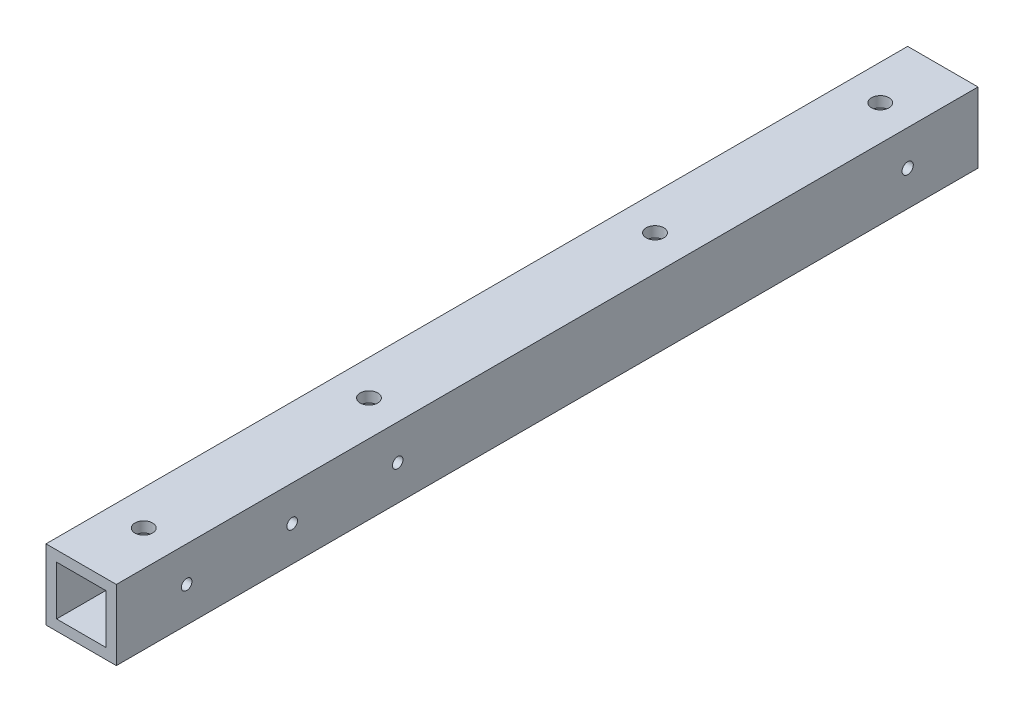
ISO-10303-21;
HEADER;
FILE_DESCRIPTION(('STEP AP214'),'2;1');
FILE_NAME('part.step','',(''),(''),'','','');
FILE_SCHEMA(('AUTOMOTIVE_DESIGN { 1 0 10303 214 1 1 1 1 }'));
ENDSEC;
DATA;
#1=APPLICATION_CONTEXT('core data for automotive mechanical design processes');
#2=APPLICATION_PROTOCOL_DEFINITION('international standard','automotive_design',2000,#1);
#3=PRODUCT_CONTEXT('',#1,'mechanical');
#4=PRODUCT('Part','Part','',(#3));
#5=PRODUCT_RELATED_PRODUCT_CATEGORY('part','',(#4));
#6=PRODUCT_DEFINITION_FORMATION('','',#4);
#7=PRODUCT_DEFINITION_CONTEXT('part definition',#1,'design');
#8=PRODUCT_DEFINITION('design','',#6,#7);
#9=PRODUCT_DEFINITION_SHAPE('','',#8);
#10=(LENGTH_UNIT() NAMED_UNIT(*) SI_UNIT(.MILLI.,.METRE.));
#11=(NAMED_UNIT(*) PLANE_ANGLE_UNIT() SI_UNIT($,.RADIAN.));
#12=(NAMED_UNIT(*) SI_UNIT($,.STERADIAN.) SOLID_ANGLE_UNIT());
#13=UNCERTAINTY_MEASURE_WITH_UNIT(LENGTH_MEASURE(1.E-05),#10,'distance_accuracy_value','');
#14=(GEOMETRIC_REPRESENTATION_CONTEXT(3) GLOBAL_UNCERTAINTY_ASSIGNED_CONTEXT((#13)) GLOBAL_UNIT_ASSIGNED_CONTEXT((#10,
#11,#12)) REPRESENTATION_CONTEXT('',''));
#15=CARTESIAN_POINT('',(0.,0.,0.));
#16=DIRECTION('',(0.,0.,1.));
#17=DIRECTION('',(1.,0.,0.));
#18=AXIS2_PLACEMENT_3D('',#15,#16,#17);
#19=CARTESIAN_POINT('',(-9.33333333333334,11.0061476485938,245.));
#20=DIRECTION('',(0.,-1.,0.));
#21=DIRECTION('',(1.,0.,0.));
#22=AXIS2_PLACEMENT_3D('',#19,#20,#21);
#23=PLANE('',#22);
#24=CARTESIAN_POINT('',(0.666666666688432,11.0061476485938,17.7882326790933));
#25=DIRECTION('',(0.,1.,0.));
#26=DIRECTION('',(-1.,0.,0.));
#27=AXIS2_PLACEMENT_3D('',#24,#25,#26);
#28=CIRCLE('',#27,2.5);
#29=CARTESIAN_POINT('',(-1.83333333331157,11.0061476485938,17.7882326790933));
#30=VERTEX_POINT('',#29);
#31=EDGE_CURVE('E194',#30,#30,#28,.T.);
#32=ORIENTED_EDGE('',*,*,#31,.F.);
#33=EDGE_LOOP('',(#32));
#34=FACE_BOUND('',#33,.T.);
#35=CARTESIAN_POINT('',(0.666666666815553,11.0061476485938,81.833059371292));
#36=DIRECTION('',(0.,1.,0.));
#37=DIRECTION('',(-1.,0.,0.));
#38=AXIS2_PLACEMENT_3D('',#35,#36,#37);
#39=CIRCLE('',#38,2.5);
#40=CARTESIAN_POINT('',(-1.83333333318445,11.0061476485938,81.833059371292));
#41=VERTEX_POINT('',#40);
#42=EDGE_CURVE('E292',#41,#41,#39,.T.);
#43=ORIENTED_EDGE('',*,*,#42,.F.);
#44=EDGE_LOOP('',(#43));
#45=FACE_BOUND('',#44,.T.);
#46=CARTESIAN_POINT('',(0.6666666669578,11.0061476485938,163.166940628601));
#47=DIRECTION('',(0.,1.,0.));
#48=DIRECTION('',(-1.,0.,0.));
#49=AXIS2_PLACEMENT_3D('',#46,#47,#48);
#50=CIRCLE('',#49,2.5);
#51=CARTESIAN_POINT('',(-1.8333333330422,11.0061476485938,163.166940628601));
#52=VERTEX_POINT('',#51);
#53=EDGE_CURVE('E296',#52,#52,#50,.T.);
#54=ORIENTED_EDGE('',*,*,#53,.F.);
#55=EDGE_LOOP('',(#54));
#56=FACE_BOUND('',#55,.T.);
#57=CARTESIAN_POINT('',(0.666666667054695,11.0061476485938,227.2117673208));
#58=DIRECTION('',(0.,1.,0.));
#59=DIRECTION('',(-1.,0.,0.));
#60=AXIS2_PLACEMENT_3D('',#57,#58,#59);
#61=CIRCLE('',#60,2.5);
#62=CARTESIAN_POINT('',(-1.83333333294531,11.0061476485938,227.2117673208));
#63=VERTEX_POINT('',#62);
#64=EDGE_CURVE('E300',#63,#63,#61,.T.);
#65=ORIENTED_EDGE('',*,*,#64,.F.);
#66=EDGE_LOOP('',(#65));
#67=FACE_BOUND('',#66,.T.);
#68=DIRECTION('',(-1.,0.,0.));
#69=VECTOR('',#68,1.);
#70=CARTESIAN_POINT('',(-9.33333333333334,11.0061476485938,0.));
#71=LINE('',#70,#69);
#72=CARTESIAN_POINT('',(10.6666666666667,11.0061476485938,0.));
#73=VERTEX_POINT('',#72);
#74=CARTESIAN_POINT('',(-9.33333333333334,11.0061476485938,0.));
#75=VERTEX_POINT('',#74);
#76=EDGE_CURVE('E141',#73,#75,#71,.T.);
#77=ORIENTED_EDGE('',*,*,#76,.T.);
#78=DIRECTION('',(0.,0.,-1.));
#79=VECTOR('',#78,1.);
#80=CARTESIAN_POINT('',(-9.33333333333334,11.0061476485938,245.));
#81=LINE('',#80,#79);
#82=CARTESIAN_POINT('',(-9.33333333333334,11.0061476485938,245.));
#83=VERTEX_POINT('',#82);
#84=EDGE_CURVE('E11',#83,#75,#81,.T.);
#85=ORIENTED_EDGE('',*,*,#84,.F.);
#86=DIRECTION('',(-1.,0.,0.));
#87=VECTOR('',#86,1.);
#88=CARTESIAN_POINT('',(-9.33333333333334,11.0061476485938,245.));
#89=LINE('',#88,#87);
#90=CARTESIAN_POINT('',(10.6666666666667,11.0061476485938,245.));
#91=VERTEX_POINT('',#90);
#92=EDGE_CURVE('E145',#91,#83,#89,.T.);
#93=ORIENTED_EDGE('',*,*,#92,.F.);
#94=DIRECTION('',(0.,0.,-1.));
#95=VECTOR('',#94,1.);
#96=CARTESIAN_POINT('',(10.6666666666667,11.0061476485938,245.));
#97=LINE('',#96,#95);
#98=EDGE_CURVE('E155',#91,#73,#97,.T.);
#99=ORIENTED_EDGE('',*,*,#98,.T.);
#100=EDGE_LOOP('',(#77,#85,#93,#99));
#101=FACE_BOUND('',#100,.T.);
#102=ADVANCED_FACE('F39',(#34,#45,#56,#67,#101),#23,.F.);
#103=CARTESIAN_POINT('',(-9.33333333333334,11.0061476485938,245.));
#104=DIRECTION('',(1.,0.,0.));
#105=DIRECTION('',(0.,0.,-1.));
#106=AXIS2_PLACEMENT_3D('',#103,#104,#105);
#107=PLANE('',#106);
#108=CARTESIAN_POINT('',(-9.33333333333334,1.00614764859386,225.));
#109=DIRECTION('',(-1.,0.,0.));
#110=DIRECTION('',(0.,0.,1.));
#111=AXIS2_PLACEMENT_3D('',#108,#109,#110);
#112=CIRCLE('',#111,1.5);
#113=CARTESIAN_POINT('',(-9.33333333333334,1.00614764859386,226.5));
#114=VERTEX_POINT('',#113);
#115=EDGE_CURVE('E174',#114,#114,#112,.T.);
#116=ORIENTED_EDGE('',*,*,#115,.F.);
#117=EDGE_LOOP('',(#116));
#118=FACE_BOUND('',#117,.T.);
#119=CARTESIAN_POINT('',(-9.33333333333334,1.00614764859386,195.));
#120=DIRECTION('',(-1.,0.,0.));
#121=DIRECTION('',(0.,0.,1.));
#122=AXIS2_PLACEMENT_3D('',#119,#120,#121);
#123=CIRCLE('',#122,1.5);
#124=CARTESIAN_POINT('',(-9.33333333333334,1.00614764859386,196.5));
#125=VERTEX_POINT('',#124);
#126=EDGE_CURVE('E227',#125,#125,#123,.T.);
#127=ORIENTED_EDGE('',*,*,#126,.F.);
#128=EDGE_LOOP('',(#127));
#129=FACE_BOUND('',#128,.T.);
#130=CARTESIAN_POINT('',(-9.33333333333334,1.00614764859387,165.));
#131=DIRECTION('',(-1.,0.,0.));
#132=DIRECTION('',(0.,0.,1.));
#133=AXIS2_PLACEMENT_3D('',#130,#131,#132);
#134=CIRCLE('',#133,1.50000000000002);
#135=CARTESIAN_POINT('',(-9.33333333333334,1.00614764859387,166.5));
#136=VERTEX_POINT('',#135);
#137=EDGE_CURVE('E230',#136,#136,#134,.T.);
#138=ORIENTED_EDGE('',*,*,#137,.F.);
#139=EDGE_LOOP('',(#138));
#140=FACE_BOUND('',#139,.T.);
#141=CARTESIAN_POINT('',(-9.33333333333334,1.00614764859194,19.9999999999818));
#142=DIRECTION('',(-1.,0.,0.));
#143=DIRECTION('',(0.,0.,1.));
#144=AXIS2_PLACEMENT_3D('',#141,#142,#143);
#145=CIRCLE('',#144,1.6);
#146=CARTESIAN_POINT('',(-9.33333333333334,1.00614764859194,21.5999999999818));
#147=VERTEX_POINT('',#146);
#148=EDGE_CURVE('E224',#147,#147,#145,.T.);
#149=ORIENTED_EDGE('',*,*,#148,.F.);
#150=EDGE_LOOP('',(#149));
#151=FACE_BOUND('',#150,.T.);
#152=DIRECTION('',(0.,-1.,0.));
#153=VECTOR('',#152,1.);
#154=CARTESIAN_POINT('',(-9.33333333333334,11.0061476485938,0.));
#155=LINE('',#154,#153);
#156=CARTESIAN_POINT('',(-9.33333333333334,-8.99385235140616,0.));
#157=VERTEX_POINT('',#156);
#158=EDGE_CURVE('E158',#75,#157,#155,.T.);
#159=ORIENTED_EDGE('',*,*,#158,.T.);
#160=DIRECTION('',(0.,0.,-1.));
#161=VECTOR('',#160,1.);
#162=CARTESIAN_POINT('',(-9.33333333333334,-8.99385235140616,245.));
#163=LINE('',#162,#161);
#164=CARTESIAN_POINT('',(-9.33333333333334,-8.99385235140616,245.));
#165=VERTEX_POINT('',#164);
#166=EDGE_CURVE('E47',#165,#157,#163,.T.);
#167=ORIENTED_EDGE('',*,*,#166,.F.);
#168=DIRECTION('',(0.,-1.,0.));
#169=VECTOR('',#168,1.);
#170=CARTESIAN_POINT('',(-9.33333333333334,11.0061476485938,245.));
#171=LINE('',#170,#169);
#172=EDGE_CURVE('E148',#83,#165,#171,.T.);
#173=ORIENTED_EDGE('',*,*,#172,.F.);
#174=ORIENTED_EDGE('',*,*,#84,.T.);
#175=EDGE_LOOP('',(#159,#167,#173,#174));
#176=FACE_BOUND('',#175,.T.);
#177=ADVANCED_FACE('F278',(#118,#129,#140,#151,#176),#107,.F.);
#178=CARTESIAN_POINT('',(-9.33333333333334,-8.99385235140616,245.));
#179=DIRECTION('',(0.,1.,0.));
#180=DIRECTION('',(-1.,0.,0.));
#181=AXIS2_PLACEMENT_3D('',#178,#179,#180);
#182=PLANE('',#181);
#183=CARTESIAN_POINT('',(0.666666666688441,-8.99385235140617,17.7882326790933));
#184=DIRECTION('',(0.,1.,0.));
#185=DIRECTION('',(-1.,0.,0.));
#186=AXIS2_PLACEMENT_3D('',#183,#184,#185);
#187=CIRCLE('',#186,2.5);
#188=CARTESIAN_POINT('',(-1.83333333331156,-8.99385235140617,17.7882326790933));
#189=VERTEX_POINT('',#188);
#190=EDGE_CURVE('E221',#189,#189,#187,.T.);
#191=ORIENTED_EDGE('',*,*,#190,.T.);
#192=EDGE_LOOP('',(#191));
#193=FACE_BOUND('',#192,.T.);
#194=CARTESIAN_POINT('',(0.666666666815561,-8.99385235140617,81.833059371292));
#195=DIRECTION('',(0.,1.,0.));
#196=DIRECTION('',(-1.,0.,0.));
#197=AXIS2_PLACEMENT_3D('',#194,#195,#196);
#198=CIRCLE('',#197,2.5);
#199=CARTESIAN_POINT('',(-1.83333333318444,-8.99385235140617,81.833059371292));
#200=VERTEX_POINT('',#199);
#201=EDGE_CURVE('E206',#200,#200,#198,.T.);
#202=ORIENTED_EDGE('',*,*,#201,.T.);
#203=EDGE_LOOP('',(#202));
#204=FACE_BOUND('',#203,.T.);
#205=CARTESIAN_POINT('',(0.666666666957809,-8.99385235140617,163.166940628601));
#206=DIRECTION('',(0.,1.,0.));
#207=DIRECTION('',(-1.,0.,0.));
#208=AXIS2_PLACEMENT_3D('',#205,#206,#207);
#209=CIRCLE('',#208,2.5);
#210=CARTESIAN_POINT('',(-1.83333333304219,-8.99385235140617,163.166940628601));
#211=VERTEX_POINT('',#210);
#212=EDGE_CURVE('E202',#211,#211,#209,.T.);
#213=ORIENTED_EDGE('',*,*,#212,.T.);
#214=EDGE_LOOP('',(#213));
#215=FACE_BOUND('',#214,.T.);
#216=CARTESIAN_POINT('',(0.666666667054703,-8.99385235140617,227.2117673208));
#217=DIRECTION('',(0.,1.,0.));
#218=DIRECTION('',(-1.,0.,0.));
#219=AXIS2_PLACEMENT_3D('',#216,#217,#218);
#220=CIRCLE('',#219,2.5);
#221=CARTESIAN_POINT('',(-1.8333333329453,-8.99385235140617,227.2117673208));
#222=VERTEX_POINT('',#221);
#223=EDGE_CURVE('E198',#222,#222,#220,.T.);
#224=ORIENTED_EDGE('',*,*,#223,.T.);
#225=EDGE_LOOP('',(#224));
#226=FACE_BOUND('',#225,.T.);
#227=DIRECTION('',(1.,0.,0.));
#228=VECTOR('',#227,1.);
#229=CARTESIAN_POINT('',(-9.33333333333334,-8.99385235140616,0.));
#230=LINE('',#229,#228);
#231=CARTESIAN_POINT('',(10.6666666666667,-8.99385235140615,0.));
#232=VERTEX_POINT('',#231);
#233=EDGE_CURVE('E160',#157,#232,#230,.T.);
#234=ORIENTED_EDGE('',*,*,#233,.T.);
#235=DIRECTION('',(0.,0.,-1.));
#236=VECTOR('',#235,1.);
#237=CARTESIAN_POINT('',(10.6666666666667,-8.99385235140615,245.));
#238=LINE('',#237,#236);
#239=CARTESIAN_POINT('',(10.6666666666667,-8.99385235140615,245.));
#240=VERTEX_POINT('',#239);
#241=EDGE_CURVE('E165',#240,#232,#238,.T.);
#242=ORIENTED_EDGE('',*,*,#241,.F.);
#243=DIRECTION('',(1.,0.,0.));
#244=VECTOR('',#243,1.);
#245=CARTESIAN_POINT('',(-9.33333333333334,-8.99385235140616,245.));
#246=LINE('',#245,#244);
#247=EDGE_CURVE('E151',#165,#240,#246,.T.);
#248=ORIENTED_EDGE('',*,*,#247,.F.);
#249=ORIENTED_EDGE('',*,*,#166,.T.);
#250=EDGE_LOOP('',(#234,#242,#248,#249));
#251=FACE_BOUND('',#250,.T.);
#252=ADVANCED_FACE('F284',(#193,#204,#215,#226,#251),#182,.F.);
#253=CARTESIAN_POINT('',(10.6666666666667,11.0061476485938,245.));
#254=DIRECTION('',(-1.,0.,0.));
#255=DIRECTION('',(0.,-1.,0.));
#256=AXIS2_PLACEMENT_3D('',#253,#254,#255);
#257=PLANE('',#256);
#258=CARTESIAN_POINT('',(10.6666666666667,1.00614764859386,225.));
#259=DIRECTION('',(-1.,0.,0.));
#260=DIRECTION('',(0.,-1.,0.));
#261=AXIS2_PLACEMENT_3D('',#258,#259,#260);
#262=CIRCLE('',#261,1.5);
#263=CARTESIAN_POINT('',(10.6666666666667,-0.493852351406142,225.));
#264=VERTEX_POINT('',#263);
#265=EDGE_CURVE('E129',#264,#264,#262,.T.);
#266=ORIENTED_EDGE('',*,*,#265,.T.);
#267=EDGE_LOOP('',(#266));
#268=FACE_BOUND('',#267,.T.);
#269=CARTESIAN_POINT('',(10.6666666666667,1.00614764859386,195.));
#270=DIRECTION('',(-1.,0.,0.));
#271=DIRECTION('',(0.,-1.,0.));
#272=AXIS2_PLACEMENT_3D('',#269,#270,#271);
#273=CIRCLE('',#272,1.5);
#274=CARTESIAN_POINT('',(10.6666666666667,-0.493852351406134,195.));
#275=VERTEX_POINT('',#274);
#276=EDGE_CURVE('E189',#275,#275,#273,.T.);
#277=ORIENTED_EDGE('',*,*,#276,.T.);
#278=EDGE_LOOP('',(#277));
#279=FACE_BOUND('',#278,.T.);
#280=CARTESIAN_POINT('',(10.6666666666667,1.00614764859387,165.));
#281=DIRECTION('',(-1.,0.,0.));
#282=DIRECTION('',(0.,-1.,0.));
#283=AXIS2_PLACEMENT_3D('',#280,#281,#282);
#284=CIRCLE('',#283,1.50000000000002);
#285=CARTESIAN_POINT('',(10.6666666666667,-0.493852351406156,165.));
#286=VERTEX_POINT('',#285);
#287=EDGE_CURVE('E184',#286,#286,#284,.T.);
#288=ORIENTED_EDGE('',*,*,#287,.T.);
#289=EDGE_LOOP('',(#288));
#290=FACE_BOUND('',#289,.T.);
#291=CARTESIAN_POINT('',(10.6666666666667,1.00614764859194,19.9999999999818));
#292=DIRECTION('',(-1.,0.,0.));
#293=DIRECTION('',(0.,-1.,0.));
#294=AXIS2_PLACEMENT_3D('',#291,#292,#293);
#295=CIRCLE('',#294,1.6);
#296=CARTESIAN_POINT('',(10.6666666666667,-0.59385235140806,19.9999999999818));
#297=VERTEX_POINT('',#296);
#298=EDGE_CURVE('E179',#297,#297,#295,.T.);
#299=ORIENTED_EDGE('',*,*,#298,.T.);
#300=EDGE_LOOP('',(#299));
#301=FACE_BOUND('',#300,.T.);
#302=DIRECTION('',(0.,1.,0.));
#303=VECTOR('',#302,1.);
#304=CARTESIAN_POINT('',(10.6666666666667,11.0061476485938,0.));
#305=LINE('',#304,#303);
#306=EDGE_CURVE('E149',#232,#73,#305,.T.);
#307=ORIENTED_EDGE('',*,*,#306,.T.);
#308=ORIENTED_EDGE('',*,*,#98,.F.);
#309=DIRECTION('',(0.,1.,0.));
#310=VECTOR('',#309,1.);
#311=CARTESIAN_POINT('',(10.6666666666667,11.0061476485938,245.));
#312=LINE('',#311,#310);
#313=EDGE_CURVE('E153',#240,#91,#312,.T.);
#314=ORIENTED_EDGE('',*,*,#313,.F.);
#315=ORIENTED_EDGE('',*,*,#241,.T.);
#316=EDGE_LOOP('',(#307,#308,#314,#315));
#317=FACE_BOUND('',#316,.T.);
#318=ADVANCED_FACE('F252',(#268,#279,#290,#301,#317),#257,.F.);
#319=CARTESIAN_POINT('',(0.,0.,245.));
#320=DIRECTION('',(0.,0.,-1.));
#321=DIRECTION('',(-1.,0.,0.));
#322=AXIS2_PLACEMENT_3D('',#319,#320,#321);
#323=PLANE('',#322);
#324=DIRECTION('',(1.,0.,0.));
#325=VECTOR('',#324,1.);
#326=CARTESIAN_POINT('',(7.66666666666666,8.00614764859384,245.));
#327=LINE('',#326,#325);
#328=CARTESIAN_POINT('',(-6.33333333333334,8.00614764859384,245.));
#329=VERTEX_POINT('',#328);
#330=CARTESIAN_POINT('',(7.66666666666666,8.00614764859384,245.));
#331=VERTEX_POINT('',#330);
#332=EDGE_CURVE('E113',#329,#331,#327,.T.);
#333=ORIENTED_EDGE('',*,*,#332,.T.);
#334=DIRECTION('',(0.,-1.,0.));
#335=VECTOR('',#334,1.);
#336=CARTESIAN_POINT('',(7.66666666666666,8.00614764859384,245.));
#337=LINE('',#336,#335);
#338=CARTESIAN_POINT('',(7.66666666666666,-5.99385235140616,245.));
#339=VERTEX_POINT('',#338);
#340=EDGE_CURVE('E107',#331,#339,#337,.T.);
#341=ORIENTED_EDGE('',*,*,#340,.T.);
#342=DIRECTION('',(-1.,0.,0.));
#343=VECTOR('',#342,1.);
#344=CARTESIAN_POINT('',(7.66666666666666,-5.99385235140616,245.));
#345=LINE('',#344,#343);
#346=CARTESIAN_POINT('',(-6.33333333333334,-5.99385235140616,245.));
#347=VERTEX_POINT('',#346);
#348=EDGE_CURVE('E116',#339,#347,#345,.T.);
#349=ORIENTED_EDGE('',*,*,#348,.T.);
#350=DIRECTION('',(0.,1.,0.));
#351=VECTOR('',#350,1.);
#352=CARTESIAN_POINT('',(-6.33333333333334,8.00614764859384,245.));
#353=LINE('',#352,#351);
#354=EDGE_CURVE('E55',#347,#329,#353,.T.);
#355=ORIENTED_EDGE('',*,*,#354,.T.);
#356=EDGE_LOOP('',(#333,#341,#349,#355));
#357=FACE_BOUND('',#356,.T.);
#358=ORIENTED_EDGE('',*,*,#92,.T.);
#359=ORIENTED_EDGE('',*,*,#172,.T.);
#360=ORIENTED_EDGE('',*,*,#247,.T.);
#361=ORIENTED_EDGE('',*,*,#313,.T.);
#362=EDGE_LOOP('',(#358,#359,#360,#361));
#363=FACE_BOUND('',#362,.T.);
#364=ADVANCED_FACE('F120',(#357,#363),#323,.F.);
#365=CARTESIAN_POINT('',(0.,0.,0.));
#366=DIRECTION('',(0.,0.,-1.));
#367=DIRECTION('',(-1.,0.,0.));
#368=AXIS2_PLACEMENT_3D('',#365,#366,#367);
#369=PLANE('',#368);
#370=DIRECTION('',(0.,-1.,0.));
#371=VECTOR('',#370,1.);
#372=CARTESIAN_POINT('',(7.66666666666666,8.00614764859384,0.));
#373=LINE('',#372,#371);
#374=CARTESIAN_POINT('',(7.66666666666666,8.00614764859384,0.));
#375=VERTEX_POINT('',#374);
#376=CARTESIAN_POINT('',(7.66666666666666,-5.99385235140616,0.));
#377=VERTEX_POINT('',#376);
#378=EDGE_CURVE('E63',#375,#377,#373,.T.);
#379=ORIENTED_EDGE('',*,*,#378,.F.);
#380=DIRECTION('',(1.,0.,0.));
#381=VECTOR('',#380,1.);
#382=CARTESIAN_POINT('',(7.66666666666666,8.00614764859384,0.));
#383=LINE('',#382,#381);
#384=CARTESIAN_POINT('',(-6.33333333333334,8.00614764859384,0.));
#385=VERTEX_POINT('',#384);
#386=EDGE_CURVE('E123',#385,#375,#383,.T.);
#387=ORIENTED_EDGE('',*,*,#386,.F.);
#388=DIRECTION('',(0.,1.,0.));
#389=VECTOR('',#388,1.);
#390=CARTESIAN_POINT('',(-6.33333333333334,8.00614764859384,0.));
#391=LINE('',#390,#389);
#392=CARTESIAN_POINT('',(-6.33333333333334,-5.99385235140616,0.));
#393=VERTEX_POINT('',#392);
#394=EDGE_CURVE('E126',#393,#385,#391,.T.);
#395=ORIENTED_EDGE('',*,*,#394,.F.);
#396=DIRECTION('',(-1.,0.,0.));
#397=VECTOR('',#396,1.);
#398=CARTESIAN_POINT('',(7.66666666666666,-5.99385235140616,0.));
#399=LINE('',#398,#397);
#400=EDGE_CURVE('E135',#377,#393,#399,.T.);
#401=ORIENTED_EDGE('',*,*,#400,.F.);
#402=EDGE_LOOP('',(#379,#387,#395,#401));
#403=FACE_BOUND('',#402,.T.);
#404=ORIENTED_EDGE('',*,*,#76,.F.);
#405=ORIENTED_EDGE('',*,*,#306,.F.);
#406=ORIENTED_EDGE('',*,*,#233,.F.);
#407=ORIENTED_EDGE('',*,*,#158,.F.);
#408=EDGE_LOOP('',(#404,#405,#406,#407));
#409=FACE_BOUND('',#408,.T.);
#410=ADVANCED_FACE('F307',(#403,#409),#369,.T.);
#411=CARTESIAN_POINT('',(7.66666666666666,8.00614764859384,245.));
#412=DIRECTION('',(1.,0.,0.));
#413=DIRECTION('',(0.,1.,0.));
#414=AXIS2_PLACEMENT_3D('',#411,#412,#413);
#415=PLANE('',#414);
#416=CARTESIAN_POINT('',(7.66666666666666,1.00614764859386,225.));
#417=DIRECTION('',(1.,0.,0.));
#418=DIRECTION('',(0.,1.,0.));
#419=AXIS2_PLACEMENT_3D('',#416,#417,#418);
#420=CIRCLE('',#419,1.5);
#421=CARTESIAN_POINT('',(7.66666666666666,2.50614764859385,225.));
#422=VERTEX_POINT('',#421);
#423=EDGE_CURVE('E188',#422,#422,#420,.T.);
#424=ORIENTED_EDGE('',*,*,#423,.T.);
#425=EDGE_LOOP('',(#424));
#426=FACE_BOUND('',#425,.T.);
#427=CARTESIAN_POINT('',(7.66666666666666,1.00614764859386,195.));
#428=DIRECTION('',(1.,0.,0.));
#429=DIRECTION('',(0.,1.,0.));
#430=AXIS2_PLACEMENT_3D('',#427,#428,#429);
#431=CIRCLE('',#430,1.5);
#432=CARTESIAN_POINT('',(7.66666666666666,2.50614764859386,195.));
#433=VERTEX_POINT('',#432);
#434=EDGE_CURVE('E183',#433,#433,#431,.T.);
#435=ORIENTED_EDGE('',*,*,#434,.T.);
#436=EDGE_LOOP('',(#435));
#437=FACE_BOUND('',#436,.T.);
#438=CARTESIAN_POINT('',(7.66666666666666,1.00614764859387,165.));
#439=DIRECTION('',(1.,0.,0.));
#440=DIRECTION('',(0.,1.,0.));
#441=AXIS2_PLACEMENT_3D('',#438,#439,#440);
#442=CIRCLE('',#441,1.50000000000002);
#443=CARTESIAN_POINT('',(7.66666666666666,2.50614764859389,165.));
#444=VERTEX_POINT('',#443);
#445=EDGE_CURVE('E178',#444,#444,#442,.T.);
#446=ORIENTED_EDGE('',*,*,#445,.T.);
#447=EDGE_LOOP('',(#446));
#448=FACE_BOUND('',#447,.T.);
#449=CARTESIAN_POINT('',(7.66666666666666,1.00614764859194,19.9999999999818));
#450=DIRECTION('',(1.,0.,0.));
#451=DIRECTION('',(0.,1.,0.));
#452=AXIS2_PLACEMENT_3D('',#449,#450,#451);
#453=CIRCLE('',#452,1.6);
#454=CARTESIAN_POINT('',(7.66666666666666,2.60614764859194,19.9999999999818));
#455=VERTEX_POINT('',#454);
#456=EDGE_CURVE('E173',#455,#455,#453,.T.);
#457=ORIENTED_EDGE('',*,*,#456,.T.);
#458=EDGE_LOOP('',(#457));
#459=FACE_BOUND('',#458,.T.);
#460=ORIENTED_EDGE('',*,*,#378,.T.);
#461=DIRECTION('',(0.,0.,-1.));
#462=VECTOR('',#461,1.);
#463=CARTESIAN_POINT('',(7.66666666666666,-5.99385235140616,245.));
#464=LINE('',#463,#462);
#465=EDGE_CURVE('E103',#339,#377,#464,.T.);
#466=ORIENTED_EDGE('',*,*,#465,.F.);
#467=ORIENTED_EDGE('',*,*,#340,.F.);
#468=DIRECTION('',(0.,0.,-1.));
#469=VECTOR('',#468,1.);
#470=CARTESIAN_POINT('',(7.66666666666666,8.00614764859384,245.));
#471=LINE('',#470,#469);
#472=EDGE_CURVE('E139',#331,#375,#471,.T.);
#473=ORIENTED_EDGE('',*,*,#472,.T.);
#474=EDGE_LOOP('',(#460,#466,#467,#473));
#475=FACE_BOUND('',#474,.T.);
#476=ADVANCED_FACE('F105',(#426,#437,#448,#459,#475),#415,.F.);
#477=CARTESIAN_POINT('',(7.66666666666666,8.00614764859384,245.));
#478=DIRECTION('',(0.,1.,0.));
#479=DIRECTION('',(0.,0.,1.));
#480=AXIS2_PLACEMENT_3D('',#477,#478,#479);
#481=PLANE('',#480);
#482=CARTESIAN_POINT('',(0.666666666688433,8.00614764859384,17.7882326790933));
#483=DIRECTION('',(0.,1.,0.));
#484=DIRECTION('',(0.,0.,1.));
#485=AXIS2_PLACEMENT_3D('',#482,#483,#484);
#486=CIRCLE('',#485,2.5);
#487=CARTESIAN_POINT('',(0.666666666688433,8.00614764859384,20.2882326790933));
#488=VERTEX_POINT('',#487);
#489=EDGE_CURVE('E218',#488,#488,#486,.T.);
#490=ORIENTED_EDGE('',*,*,#489,.T.);
#491=EDGE_LOOP('',(#490));
#492=FACE_BOUND('',#491,.T.);
#493=CARTESIAN_POINT('',(0.666666666815554,8.00614764859384,81.833059371292));
#494=DIRECTION('',(0.,1.,0.));
#495=DIRECTION('',(0.,0.,1.));
#496=AXIS2_PLACEMENT_3D('',#493,#494,#495);
#497=CIRCLE('',#496,2.5);
#498=CARTESIAN_POINT('',(0.666666666815554,8.00614764859384,84.333059371292));
#499=VERTEX_POINT('',#498);
#500=EDGE_CURVE('E201',#499,#499,#497,.T.);
#501=ORIENTED_EDGE('',*,*,#500,.T.);
#502=EDGE_LOOP('',(#501));
#503=FACE_BOUND('',#502,.T.);
#504=CARTESIAN_POINT('',(0.666666666957801,8.00614764859384,163.166940628601));
#505=DIRECTION('',(0.,1.,0.));
#506=DIRECTION('',(0.,0.,1.));
#507=AXIS2_PLACEMENT_3D('',#504,#505,#506);
#508=CIRCLE('',#507,2.5);
#509=CARTESIAN_POINT('',(0.666666666957801,8.00614764859384,165.666940628601));
#510=VERTEX_POINT('',#509);
#511=EDGE_CURVE('E197',#510,#510,#508,.T.);
#512=ORIENTED_EDGE('',*,*,#511,.T.);
#513=EDGE_LOOP('',(#512));
#514=FACE_BOUND('',#513,.T.);
#515=CARTESIAN_POINT('',(0.666666667054696,8.00614764859384,227.2117673208));
#516=DIRECTION('',(0.,1.,0.));
#517=DIRECTION('',(0.,0.,1.));
#518=AXIS2_PLACEMENT_3D('',#515,#516,#517);
#519=CIRCLE('',#518,2.5);
#520=CARTESIAN_POINT('',(0.666666667054696,8.00614764859384,229.7117673208));
#521=VERTEX_POINT('',#520);
#522=EDGE_CURVE('E193',#521,#521,#519,.T.);
#523=ORIENTED_EDGE('',*,*,#522,.T.);
#524=EDGE_LOOP('',(#523));
#525=FACE_BOUND('',#524,.T.);
#526=ORIENTED_EDGE('',*,*,#386,.T.);
#527=ORIENTED_EDGE('',*,*,#472,.F.);
#528=ORIENTED_EDGE('',*,*,#332,.F.);
#529=DIRECTION('',(0.,0.,-1.));
#530=VECTOR('',#529,1.);
#531=CARTESIAN_POINT('',(-6.33333333333334,8.00614764859384,245.));
#532=LINE('',#531,#530);
#533=EDGE_CURVE('E142',#329,#385,#532,.T.);
#534=ORIENTED_EDGE('',*,*,#533,.T.);
#535=EDGE_LOOP('',(#526,#527,#528,#534));
#536=FACE_BOUND('',#535,.T.);
#537=ADVANCED_FACE('F332',(#492,#503,#514,#525,#536),#481,.F.);
#538=CARTESIAN_POINT('',(-6.33333333333334,8.00614764859384,245.));
#539=DIRECTION('',(-1.,0.,0.));
#540=DIRECTION('',(0.,0.,1.));
#541=AXIS2_PLACEMENT_3D('',#538,#539,#540);
#542=PLANE('',#541);
#543=CARTESIAN_POINT('',(-6.33333333333334,1.00614764859386,225.));
#544=DIRECTION('',(-1.,0.,0.));
#545=DIRECTION('',(0.,0.,1.));
#546=AXIS2_PLACEMENT_3D('',#543,#544,#545);
#547=CIRCLE('',#546,1.5);
#548=CARTESIAN_POINT('',(-6.33333333333334,1.00614764859386,226.5));
#549=VERTEX_POINT('',#548);
#550=EDGE_CURVE('E185',#549,#549,#547,.T.);
#551=ORIENTED_EDGE('',*,*,#550,.T.);
#552=EDGE_LOOP('',(#551));
#553=FACE_BOUND('',#552,.T.);
#554=CARTESIAN_POINT('',(-6.33333333333334,1.00614764859386,195.));
#555=DIRECTION('',(-1.,0.,0.));
#556=DIRECTION('',(0.,0.,1.));
#557=AXIS2_PLACEMENT_3D('',#554,#555,#556);
#558=CIRCLE('',#557,1.5);
#559=CARTESIAN_POINT('',(-6.33333333333334,1.00614764859386,196.5));
#560=VERTEX_POINT('',#559);
#561=EDGE_CURVE('E180',#560,#560,#558,.T.);
#562=ORIENTED_EDGE('',*,*,#561,.T.);
#563=EDGE_LOOP('',(#562));
#564=FACE_BOUND('',#563,.T.);
#565=CARTESIAN_POINT('',(-6.33333333333334,1.00614764859387,165.));
#566=DIRECTION('',(-1.,0.,0.));
#567=DIRECTION('',(0.,0.,1.));
#568=AXIS2_PLACEMENT_3D('',#565,#566,#567);
#569=CIRCLE('',#568,1.50000000000002);
#570=CARTESIAN_POINT('',(-6.33333333333334,1.00614764859387,166.5));
#571=VERTEX_POINT('',#570);
#572=EDGE_CURVE('E175',#571,#571,#569,.T.);
#573=ORIENTED_EDGE('',*,*,#572,.T.);
#574=EDGE_LOOP('',(#573));
#575=FACE_BOUND('',#574,.T.);
#576=CARTESIAN_POINT('',(-6.33333333333334,1.00614764859194,19.9999999999818));
#577=DIRECTION('',(-1.,0.,0.));
#578=DIRECTION('',(0.,0.,1.));
#579=AXIS2_PLACEMENT_3D('',#576,#577,#578);
#580=CIRCLE('',#579,1.6);
#581=CARTESIAN_POINT('',(-6.33333333333334,1.00614764859194,21.5999999999818));
#582=VERTEX_POINT('',#581);
#583=EDGE_CURVE('E170',#582,#582,#580,.T.);
#584=ORIENTED_EDGE('',*,*,#583,.T.);
#585=EDGE_LOOP('',(#584));
#586=FACE_BOUND('',#585,.T.);
#587=ORIENTED_EDGE('',*,*,#394,.T.);
#588=ORIENTED_EDGE('',*,*,#533,.F.);
#589=ORIENTED_EDGE('',*,*,#354,.F.);
#590=DIRECTION('',(0.,0.,-1.));
#591=VECTOR('',#590,1.);
#592=CARTESIAN_POINT('',(-6.33333333333334,-5.99385235140616,245.));
#593=LINE('',#592,#591);
#594=EDGE_CURVE('E112',#347,#393,#593,.T.);
#595=ORIENTED_EDGE('',*,*,#594,.T.);
#596=EDGE_LOOP('',(#587,#588,#589,#595));
#597=FACE_BOUND('',#596,.T.);
#598=ADVANCED_FACE('F336',(#553,#564,#575,#586,#597),#542,.F.);
#599=CARTESIAN_POINT('',(7.66666666666666,-5.99385235140616,245.));
#600=DIRECTION('',(0.,-1.,0.));
#601=DIRECTION('',(0.,0.,-1.));
#602=AXIS2_PLACEMENT_3D('',#599,#600,#601);
#603=PLANE('',#602);
#604=CARTESIAN_POINT('',(0.666666666688439,-5.99385235140616,17.7882326790933));
#605=DIRECTION('',(0.,-1.,0.));
#606=DIRECTION('',(0.,0.,-1.));
#607=AXIS2_PLACEMENT_3D('',#604,#605,#606);
#608=CIRCLE('',#607,2.5);
#609=CARTESIAN_POINT('',(0.666666666688439,-5.99385235140616,15.2882326790933));
#610=VERTEX_POINT('',#609);
#611=EDGE_CURVE('E42',#610,#610,#608,.T.);
#612=ORIENTED_EDGE('',*,*,#611,.T.);
#613=EDGE_LOOP('',(#612));
#614=FACE_BOUND('',#613,.T.);
#615=CARTESIAN_POINT('',(0.66666666681556,-5.99385235140616,81.833059371292));
#616=DIRECTION('',(0.,-1.,0.));
#617=DIRECTION('',(0.,0.,-1.));
#618=AXIS2_PLACEMENT_3D('',#615,#616,#617);
#619=CIRCLE('',#618,2.5);
#620=CARTESIAN_POINT('',(0.66666666681556,-5.99385235140616,79.333059371292));
#621=VERTEX_POINT('',#620);
#622=EDGE_CURVE('E199',#621,#621,#619,.T.);
#623=ORIENTED_EDGE('',*,*,#622,.T.);
#624=EDGE_LOOP('',(#623));
#625=FACE_BOUND('',#624,.T.);
#626=CARTESIAN_POINT('',(0.666666666957807,-5.99385235140616,163.166940628601));
#627=DIRECTION('',(0.,-1.,0.));
#628=DIRECTION('',(0.,0.,-1.));
#629=AXIS2_PLACEMENT_3D('',#626,#627,#628);
#630=CIRCLE('',#629,2.5);
#631=CARTESIAN_POINT('',(0.666666666957807,-5.99385235140616,160.666940628601));
#632=VERTEX_POINT('',#631);
#633=EDGE_CURVE('E195',#632,#632,#630,.T.);
#634=ORIENTED_EDGE('',*,*,#633,.T.);
#635=EDGE_LOOP('',(#634));
#636=FACE_BOUND('',#635,.T.);
#637=CARTESIAN_POINT('',(0.666666667054702,-5.99385235140616,227.2117673208));
#638=DIRECTION('',(0.,-1.,0.));
#639=DIRECTION('',(0.,0.,-1.));
#640=AXIS2_PLACEMENT_3D('',#637,#638,#639);
#641=CIRCLE('',#640,2.5);
#642=CARTESIAN_POINT('',(0.666666667054702,-5.99385235140616,224.7117673208));
#643=VERTEX_POINT('',#642);
#644=EDGE_CURVE('E190',#643,#643,#641,.T.);
#645=ORIENTED_EDGE('',*,*,#644,.T.);
#646=EDGE_LOOP('',(#645));
#647=FACE_BOUND('',#646,.T.);
#648=ORIENTED_EDGE('',*,*,#400,.T.);
#649=ORIENTED_EDGE('',*,*,#594,.F.);
#650=ORIENTED_EDGE('',*,*,#348,.F.);
#651=ORIENTED_EDGE('',*,*,#465,.T.);
#652=EDGE_LOOP('',(#648,#649,#650,#651));
#653=FACE_BOUND('',#652,.T.);
#654=ADVANCED_FACE('F117',(#614,#625,#636,#647,#653),#603,.F.);
#655=CARTESIAN_POINT('',(70.6666666666667,1.00614764859194,19.9999999999818));
#656=DIRECTION('',(-1.,0.,0.));
#657=DIRECTION('',(0.,0.,1.));
#658=AXIS2_PLACEMENT_3D('',#655,#656,#657);
#659=CYLINDRICAL_SURFACE('',#658,1.6);
#660=ORIENTED_EDGE('',*,*,#148,.T.);
#661=EDGE_LOOP('',(#660));
#662=FACE_BOUND('',#661,.T.);
#663=ORIENTED_EDGE('',*,*,#583,.F.);
#664=EDGE_LOOP('',(#663));
#665=FACE_BOUND('',#664,.T.);
#666=ADVANCED_FACE('F335',(#662,#665),#659,.F.);
#667=CARTESIAN_POINT('',(70.6666666666667,1.00614764859387,165.));
#668=DIRECTION('',(-1.,0.,0.));
#669=DIRECTION('',(0.,0.,1.));
#670=AXIS2_PLACEMENT_3D('',#667,#668,#669);
#671=CYLINDRICAL_SURFACE('',#670,1.50000000000002);
#672=ORIENTED_EDGE('',*,*,#137,.T.);
#673=EDGE_LOOP('',(#672));
#674=FACE_BOUND('',#673,.T.);
#675=ORIENTED_EDGE('',*,*,#572,.F.);
#676=EDGE_LOOP('',(#675));
#677=FACE_BOUND('',#676,.T.);
#678=ADVANCED_FACE('F348',(#674,#677),#671,.F.);
#679=CARTESIAN_POINT('',(70.6666666666667,1.00614764859386,195.));
#680=DIRECTION('',(-1.,0.,0.));
#681=DIRECTION('',(0.,0.,1.));
#682=AXIS2_PLACEMENT_3D('',#679,#680,#681);
#683=CYLINDRICAL_SURFACE('',#682,1.5);
#684=ORIENTED_EDGE('',*,*,#126,.T.);
#685=EDGE_LOOP('',(#684));
#686=FACE_BOUND('',#685,.T.);
#687=ORIENTED_EDGE('',*,*,#561,.F.);
#688=EDGE_LOOP('',(#687));
#689=FACE_BOUND('',#688,.T.);
#690=ADVANCED_FACE('F273',(#686,#689),#683,.F.);
#691=CARTESIAN_POINT('',(70.6666666666667,1.00614764859386,225.));
#692=DIRECTION('',(-1.,0.,0.));
#693=DIRECTION('',(0.,0.,1.));
#694=AXIS2_PLACEMENT_3D('',#691,#692,#693);
#695=CYLINDRICAL_SURFACE('',#694,1.5);
#696=ORIENTED_EDGE('',*,*,#115,.T.);
#697=EDGE_LOOP('',(#696));
#698=FACE_BOUND('',#697,.T.);
#699=ORIENTED_EDGE('',*,*,#550,.F.);
#700=EDGE_LOOP('',(#699));
#701=FACE_BOUND('',#700,.T.);
#702=ADVANCED_FACE('F261',(#698,#701),#695,.F.);
#703=ORIENTED_EDGE('',*,*,#456,.F.);
#704=EDGE_LOOP('',(#703));
#705=FACE_BOUND('',#704,.T.);
#706=ORIENTED_EDGE('',*,*,#298,.F.);
#707=EDGE_LOOP('',(#706));
#708=FACE_BOUND('',#707,.T.);
#709=ADVANCED_FACE('F275',(#705,#708),#659,.F.);
#710=ORIENTED_EDGE('',*,*,#445,.F.);
#711=EDGE_LOOP('',(#710));
#712=FACE_BOUND('',#711,.T.);
#713=ORIENTED_EDGE('',*,*,#287,.F.);
#714=EDGE_LOOP('',(#713));
#715=FACE_BOUND('',#714,.T.);
#716=ADVANCED_FACE('F270',(#712,#715),#671,.F.);
#717=ORIENTED_EDGE('',*,*,#434,.F.);
#718=EDGE_LOOP('',(#717));
#719=FACE_BOUND('',#718,.T.);
#720=ORIENTED_EDGE('',*,*,#276,.F.);
#721=EDGE_LOOP('',(#720));
#722=FACE_BOUND('',#721,.T.);
#723=ADVANCED_FACE('F258',(#719,#722),#683,.F.);
#724=ORIENTED_EDGE('',*,*,#423,.F.);
#725=EDGE_LOOP('',(#724));
#726=FACE_BOUND('',#725,.T.);
#727=ORIENTED_EDGE('',*,*,#265,.F.);
#728=EDGE_LOOP('',(#727));
#729=FACE_BOUND('',#728,.T.);
#730=ADVANCED_FACE('F255',(#726,#729),#695,.F.);
#731=CARTESIAN_POINT('',(0.666666667054735,-81.9938523514062,227.2117673208));
#732=DIRECTION('',(0.,1.,0.));
#733=DIRECTION('',(-1.,0.,0.));
#734=AXIS2_PLACEMENT_3D('',#731,#732,#733);
#735=CYLINDRICAL_SURFACE('',#734,2.5);
#736=ORIENTED_EDGE('',*,*,#644,.F.);
#737=EDGE_LOOP('',(#736));
#738=FACE_BOUND('',#737,.T.);
#739=ORIENTED_EDGE('',*,*,#223,.F.);
#740=EDGE_LOOP('',(#739));
#741=FACE_BOUND('',#740,.T.);
#742=ADVANCED_FACE('F257',(#738,#741),#735,.F.);
#743=CARTESIAN_POINT('',(0.66666666695784,-81.9938523514062,163.166940628601));
#744=DIRECTION('',(0.,1.,0.));
#745=DIRECTION('',(-1.,0.,0.));
#746=AXIS2_PLACEMENT_3D('',#743,#744,#745);
#747=CYLINDRICAL_SURFACE('',#746,2.5);
#748=ORIENTED_EDGE('',*,*,#633,.F.);
#749=EDGE_LOOP('',(#748));
#750=FACE_BOUND('',#749,.T.);
#751=ORIENTED_EDGE('',*,*,#212,.F.);
#752=EDGE_LOOP('',(#751));
#753=FACE_BOUND('',#752,.T.);
#754=ADVANCED_FACE('F266',(#750,#753),#747,.F.);
#755=CARTESIAN_POINT('',(0.666666666815593,-81.9938523514062,81.833059371292));
#756=DIRECTION('',(0.,1.,0.));
#757=DIRECTION('',(-1.,0.,0.));
#758=AXIS2_PLACEMENT_3D('',#755,#756,#757);
#759=CYLINDRICAL_SURFACE('',#758,2.5);
#760=ORIENTED_EDGE('',*,*,#622,.F.);
#761=EDGE_LOOP('',(#760));
#762=FACE_BOUND('',#761,.T.);
#763=ORIENTED_EDGE('',*,*,#201,.F.);
#764=EDGE_LOOP('',(#763));
#765=FACE_BOUND('',#764,.T.);
#766=ADVANCED_FACE('F508',(#762,#765),#759,.F.);
#767=CARTESIAN_POINT('',(0.666666666688472,-81.9938523514062,17.7882326790933));
#768=DIRECTION('',(0.,1.,0.));
#769=DIRECTION('',(-1.,0.,0.));
#770=AXIS2_PLACEMENT_3D('',#767,#768,#769);
#771=CYLINDRICAL_SURFACE('',#770,2.5);
#772=ORIENTED_EDGE('',*,*,#611,.F.);
#773=EDGE_LOOP('',(#772));
#774=FACE_BOUND('',#773,.T.);
#775=ORIENTED_EDGE('',*,*,#190,.F.);
#776=EDGE_LOOP('',(#775));
#777=FACE_BOUND('',#776,.T.);
#778=ADVANCED_FACE('F519',(#774,#777),#771,.F.);
#779=ORIENTED_EDGE('',*,*,#64,.T.);
#780=EDGE_LOOP('',(#779));
#781=FACE_BOUND('',#780,.T.);
#782=ORIENTED_EDGE('',*,*,#522,.F.);
#783=EDGE_LOOP('',(#782));
#784=FACE_BOUND('',#783,.T.);
#785=ADVANCED_FACE('F269',(#781,#784),#735,.F.);
#786=ORIENTED_EDGE('',*,*,#53,.T.);
#787=EDGE_LOOP('',(#786));
#788=FACE_BOUND('',#787,.T.);
#789=ORIENTED_EDGE('',*,*,#511,.F.);
#790=EDGE_LOOP('',(#789));
#791=FACE_BOUND('',#790,.T.);
#792=ADVANCED_FACE('F511',(#788,#791),#747,.F.);
#793=ORIENTED_EDGE('',*,*,#42,.T.);
#794=EDGE_LOOP('',(#793));
#795=FACE_BOUND('',#794,.T.);
#796=ORIENTED_EDGE('',*,*,#500,.F.);
#797=EDGE_LOOP('',(#796));
#798=FACE_BOUND('',#797,.T.);
#799=ADVANCED_FACE('F522',(#795,#798),#759,.F.);
#800=ORIENTED_EDGE('',*,*,#31,.T.);
#801=EDGE_LOOP('',(#800));
#802=FACE_BOUND('',#801,.T.);
#803=ORIENTED_EDGE('',*,*,#489,.F.);
#804=EDGE_LOOP('',(#803));
#805=FACE_BOUND('',#804,.T.);
#806=ADVANCED_FACE('F532',(#802,#805),#771,.F.);
#807=CLOSED_SHELL('',(#102,#177,#252,#318,#364,#410,#476,#537,#598,#654,#666,#678,#690,#702,
#709,#716,#723,#730,#742,#754,#766,#778,#785,#792,#799,#806));
#808=MANIFOLD_SOLID_BREP('B2',#807);
#809=ADVANCED_BREP_SHAPE_REPRESENTATION('',(#18,#808),#14);
#810=SHAPE_DEFINITION_REPRESENTATION(#9,#809);
ENDSEC;
END-ISO-10303-21;
